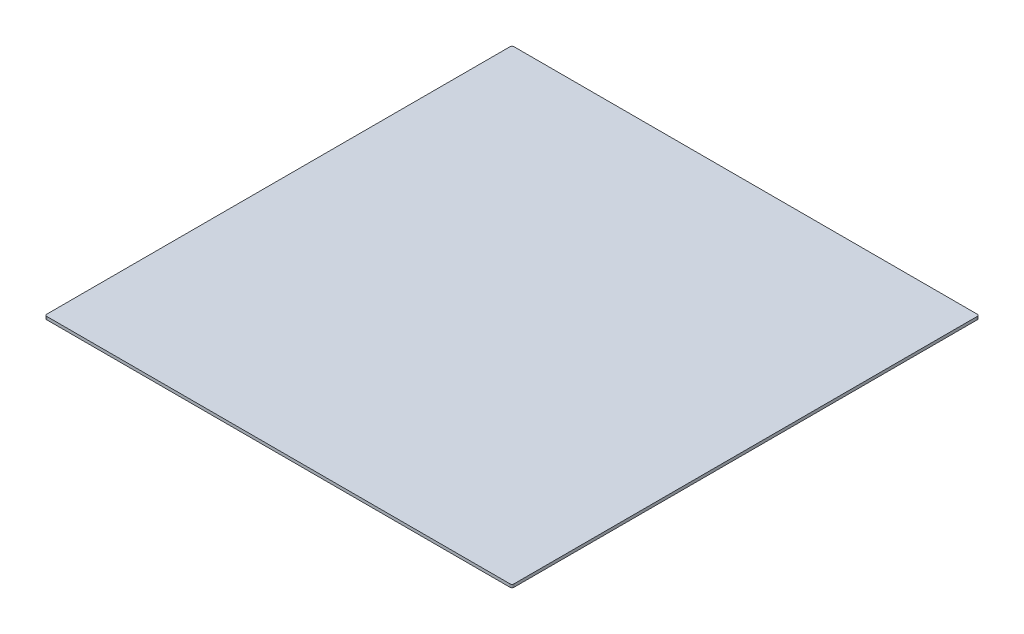
ISO-10303-21;
HEADER;
FILE_DESCRIPTION(('STEP AP214'),'2;1');
FILE_NAME('part.step','',(''),(''),'','','');
FILE_SCHEMA(('AUTOMOTIVE_DESIGN { 1 0 10303 214 1 1 1 1 }'));
ENDSEC;
DATA;
#1=APPLICATION_CONTEXT('core data for automotive mechanical design processes');
#2=APPLICATION_PROTOCOL_DEFINITION('international standard','automotive_design',2000,#1);
#3=PRODUCT_CONTEXT('',#1,'mechanical');
#4=PRODUCT('Part','Part','',(#3));
#5=PRODUCT_RELATED_PRODUCT_CATEGORY('part','',(#4));
#6=PRODUCT_DEFINITION_FORMATION('','',#4);
#7=PRODUCT_DEFINITION_CONTEXT('part definition',#1,'design');
#8=PRODUCT_DEFINITION('design','',#6,#7);
#9=PRODUCT_DEFINITION_SHAPE('','',#8);
#10=(LENGTH_UNIT() NAMED_UNIT(*) SI_UNIT(.MILLI.,.METRE.));
#11=(NAMED_UNIT(*) PLANE_ANGLE_UNIT() SI_UNIT($,.RADIAN.));
#12=(NAMED_UNIT(*) SI_UNIT($,.STERADIAN.) SOLID_ANGLE_UNIT());
#13=UNCERTAINTY_MEASURE_WITH_UNIT(LENGTH_MEASURE(1.E-05),#10,'distance_accuracy_value','');
#14=(GEOMETRIC_REPRESENTATION_CONTEXT(3) GLOBAL_UNCERTAINTY_ASSIGNED_CONTEXT((#13)) GLOBAL_UNIT_ASSIGNED_CONTEXT((#10,
#11,#12)) REPRESENTATION_CONTEXT('',''));
#15=CARTESIAN_POINT('',(0.,0.,0.));
#16=DIRECTION('',(0.,0.,1.));
#17=DIRECTION('',(1.,0.,0.));
#18=AXIS2_PLACEMENT_3D('',#15,#16,#17);
#19=CARTESIAN_POINT('',(232.5,3.,232.5));
#20=DIRECTION('',(0.,-1.,0.));
#21=DIRECTION('',(0.,0.,-1.));
#22=AXIS2_PLACEMENT_3D('',#19,#20,#21);
#23=CYLINDRICAL_SURFACE('',#22,2.);
#24=CARTESIAN_POINT('',(232.5,0.,232.5));
#25=DIRECTION('',(0.,1.,0.));
#26=DIRECTION('',(0.,0.,1.));
#27=AXIS2_PLACEMENT_3D('',#24,#25,#26);
#28=CIRCLE('',#27,2.);
#29=CARTESIAN_POINT('',(232.5,0.,234.5));
#30=VERTEX_POINT('',#29);
#31=CARTESIAN_POINT('',(234.5,0.,232.5));
#32=VERTEX_POINT('',#31);
#33=EDGE_CURVE('E208',#30,#32,#28,.T.);
#34=ORIENTED_EDGE('',*,*,#33,.T.);
#35=DIRECTION('',(0.,-1.,0.));
#36=VECTOR('',#35,1.);
#37=CARTESIAN_POINT('',(234.5,3.,232.5));
#38=LINE('',#37,#36);
#39=CARTESIAN_POINT('',(234.5,3.,232.5));
#40=VERTEX_POINT('',#39);
#41=EDGE_CURVE('E12',#40,#32,#38,.T.);
#42=ORIENTED_EDGE('',*,*,#41,.F.);
#43=CARTESIAN_POINT('',(232.5,3.,232.5));
#44=DIRECTION('',(0.,1.,0.));
#45=DIRECTION('',(0.,0.,1.));
#46=AXIS2_PLACEMENT_3D('',#43,#44,#45);
#47=CIRCLE('',#46,2.);
#48=CARTESIAN_POINT('',(232.5,3.,234.5));
#49=VERTEX_POINT('',#48);
#50=EDGE_CURVE('E162',#49,#40,#47,.T.);
#51=ORIENTED_EDGE('',*,*,#50,.F.);
#52=DIRECTION('',(0.,-1.,0.));
#53=VECTOR('',#52,1.);
#54=CARTESIAN_POINT('',(232.5,3.,234.5));
#55=LINE('',#54,#53);
#56=EDGE_CURVE('E137',#49,#30,#55,.T.);
#57=ORIENTED_EDGE('',*,*,#56,.T.);
#58=EDGE_LOOP('',(#34,#42,#51,#57));
#59=FACE_BOUND('',#58,.T.);
#60=ADVANCED_FACE('F40',(#59),#23,.T.);
#61=CARTESIAN_POINT('',(234.5,3.,232.5));
#62=DIRECTION('',(-1.,0.,0.));
#63=DIRECTION('',(0.,0.,1.));
#64=AXIS2_PLACEMENT_3D('',#61,#62,#63);
#65=PLANE('',#64);
#66=DIRECTION('',(0.,0.,-1.));
#67=VECTOR('',#66,1.);
#68=CARTESIAN_POINT('',(234.5,0.,232.5));
#69=LINE('',#68,#67);
#70=CARTESIAN_POINT('',(234.5,0.,-232.5));
#71=VERTEX_POINT('',#70);
#72=EDGE_CURVE('E199',#32,#71,#69,.T.);
#73=ORIENTED_EDGE('',*,*,#72,.T.);
#74=DIRECTION('',(0.,-1.,0.));
#75=VECTOR('',#74,1.);
#76=CARTESIAN_POINT('',(234.5,3.,-232.5));
#77=LINE('',#76,#75);
#78=CARTESIAN_POINT('',(234.5,3.,-232.5));
#79=VERTEX_POINT('',#78);
#80=EDGE_CURVE('E49',#79,#71,#77,.T.);
#81=ORIENTED_EDGE('',*,*,#80,.F.);
#82=DIRECTION('',(0.,0.,-1.));
#83=VECTOR('',#82,1.);
#84=CARTESIAN_POINT('',(234.5,3.,232.5));
#85=LINE('',#84,#83);
#86=EDGE_CURVE('E100',#40,#79,#85,.T.);
#87=ORIENTED_EDGE('',*,*,#86,.F.);
#88=ORIENTED_EDGE('',*,*,#41,.T.);
#89=EDGE_LOOP('',(#73,#81,#87,#88));
#90=FACE_BOUND('',#89,.T.);
#91=ADVANCED_FACE('F230',(#90),#65,.F.);
#92=CARTESIAN_POINT('',(232.5,3.,-232.5));
#93=DIRECTION('',(0.,-1.,0.));
#94=DIRECTION('',(0.,0.,-1.));
#95=AXIS2_PLACEMENT_3D('',#92,#93,#94);
#96=CYLINDRICAL_SURFACE('',#95,1.99999999999999);
#97=CARTESIAN_POINT('',(232.5,0.,-232.5));
#98=DIRECTION('',(0.,1.,0.));
#99=DIRECTION('',(0.,0.,-1.));
#100=AXIS2_PLACEMENT_3D('',#97,#98,#99);
#101=CIRCLE('',#100,1.99999999999999);
#102=CARTESIAN_POINT('',(232.5,0.,-234.5));
#103=VERTEX_POINT('',#102);
#104=EDGE_CURVE('E194',#71,#103,#101,.T.);
#105=ORIENTED_EDGE('',*,*,#104,.T.);
#106=DIRECTION('',(0.,-1.,0.));
#107=VECTOR('',#106,1.);
#108=CARTESIAN_POINT('',(232.5,3.,-234.5));
#109=LINE('',#108,#107);
#110=CARTESIAN_POINT('',(232.5,3.,-234.5));
#111=VERTEX_POINT('',#110);
#112=EDGE_CURVE('E184',#111,#103,#109,.T.);
#113=ORIENTED_EDGE('',*,*,#112,.F.);
#114=CARTESIAN_POINT('',(232.5,3.,-232.5));
#115=DIRECTION('',(0.,1.,0.));
#116=DIRECTION('',(0.,0.,-1.));
#117=AXIS2_PLACEMENT_3D('',#114,#115,#116);
#118=CIRCLE('',#117,1.99999999999999);
#119=EDGE_CURVE('E154',#79,#111,#118,.T.);
#120=ORIENTED_EDGE('',*,*,#119,.F.);
#121=ORIENTED_EDGE('',*,*,#80,.T.);
#122=EDGE_LOOP('',(#105,#113,#120,#121));
#123=FACE_BOUND('',#122,.T.);
#124=ADVANCED_FACE('F192',(#123),#96,.T.);
#125=CARTESIAN_POINT('',(-232.5,3.,-234.5));
#126=DIRECTION('',(0.,0.,1.));
#127=DIRECTION('',(1.,0.,0.));
#128=AXIS2_PLACEMENT_3D('',#125,#126,#127);
#129=PLANE('',#128);
#130=DIRECTION('',(-1.,0.,0.));
#131=VECTOR('',#130,1.);
#132=CARTESIAN_POINT('',(-232.5,0.,-234.5));
#133=LINE('',#132,#131);
#134=CARTESIAN_POINT('',(-232.5,0.,-234.5));
#135=VERTEX_POINT('',#134);
#136=EDGE_CURVE('E201',#103,#135,#133,.T.);
#137=ORIENTED_EDGE('',*,*,#136,.T.);
#138=DIRECTION('',(0.,-1.,0.));
#139=VECTOR('',#138,1.);
#140=CARTESIAN_POINT('',(-232.5,3.,-234.5));
#141=LINE('',#140,#139);
#142=CARTESIAN_POINT('',(-232.5,3.,-234.5));
#143=VERTEX_POINT('',#142);
#144=EDGE_CURVE('E180',#143,#135,#141,.T.);
#145=ORIENTED_EDGE('',*,*,#144,.F.);
#146=DIRECTION('',(-1.,0.,0.));
#147=VECTOR('',#146,1.);
#148=CARTESIAN_POINT('',(-232.5,3.,-234.5));
#149=LINE('',#148,#147);
#150=EDGE_CURVE('E150',#111,#143,#149,.T.);
#151=ORIENTED_EDGE('',*,*,#150,.F.);
#152=ORIENTED_EDGE('',*,*,#112,.T.);
#153=EDGE_LOOP('',(#137,#145,#151,#152));
#154=FACE_BOUND('',#153,.T.);
#155=ADVANCED_FACE('F237',(#154),#129,.F.);
#156=CARTESIAN_POINT('',(-232.5,3.,-232.5));
#157=DIRECTION('',(0.,-1.,0.));
#158=DIRECTION('',(0.,0.,-1.));
#159=AXIS2_PLACEMENT_3D('',#156,#157,#158);
#160=CYLINDRICAL_SURFACE('',#159,1.99999999999999);
#161=CARTESIAN_POINT('',(-232.5,0.,-232.5));
#162=DIRECTION('',(0.,1.,0.));
#163=DIRECTION('',(0.,0.,-1.));
#164=AXIS2_PLACEMENT_3D('',#161,#162,#163);
#165=CIRCLE('',#164,1.99999999999999);
#166=CARTESIAN_POINT('',(-234.5,0.,-232.5));
#167=VERTEX_POINT('',#166);
#168=EDGE_CURVE('E206',#135,#167,#165,.T.);
#169=ORIENTED_EDGE('',*,*,#168,.T.);
#170=DIRECTION('',(0.,-1.,0.));
#171=VECTOR('',#170,1.);
#172=CARTESIAN_POINT('',(-234.5,3.,-232.5));
#173=LINE('',#172,#171);
#174=CARTESIAN_POINT('',(-234.5,3.,-232.5));
#175=VERTEX_POINT('',#174);
#176=EDGE_CURVE('E130',#175,#167,#173,.T.);
#177=ORIENTED_EDGE('',*,*,#176,.F.);
#178=CARTESIAN_POINT('',(-232.5,3.,-232.5));
#179=DIRECTION('',(0.,1.,0.));
#180=DIRECTION('',(0.,0.,-1.));
#181=AXIS2_PLACEMENT_3D('',#178,#179,#180);
#182=CIRCLE('',#181,1.99999999999999);
#183=EDGE_CURVE('E119',#143,#175,#182,.T.);
#184=ORIENTED_EDGE('',*,*,#183,.F.);
#185=ORIENTED_EDGE('',*,*,#144,.T.);
#186=EDGE_LOOP('',(#169,#177,#184,#185));
#187=FACE_BOUND('',#186,.T.);
#188=ADVANCED_FACE('F214',(#187),#160,.T.);
#189=CARTESIAN_POINT('',(-234.5,3.,232.5));
#190=DIRECTION('',(1.,0.,0.));
#191=DIRECTION('',(0.,0.,-1.));
#192=AXIS2_PLACEMENT_3D('',#189,#190,#191);
#193=PLANE('',#192);
#194=DIRECTION('',(0.,0.,1.));
#195=VECTOR('',#194,1.);
#196=CARTESIAN_POINT('',(-234.5,0.,232.5));
#197=LINE('',#196,#195);
#198=CARTESIAN_POINT('',(-234.5,0.,232.5));
#199=VERTEX_POINT('',#198);
#200=EDGE_CURVE('E128',#167,#199,#197,.T.);
#201=ORIENTED_EDGE('',*,*,#200,.T.);
#202=DIRECTION('',(0.,-1.,0.));
#203=VECTOR('',#202,1.);
#204=CARTESIAN_POINT('',(-234.5,3.,232.5));
#205=LINE('',#204,#203);
#206=CARTESIAN_POINT('',(-234.5,3.,232.5));
#207=VERTEX_POINT('',#206);
#208=EDGE_CURVE('E125',#207,#199,#205,.T.);
#209=ORIENTED_EDGE('',*,*,#208,.F.);
#210=DIRECTION('',(0.,0.,1.));
#211=VECTOR('',#210,1.);
#212=CARTESIAN_POINT('',(-234.5,3.,232.5));
#213=LINE('',#212,#211);
#214=EDGE_CURVE('E113',#175,#207,#213,.T.);
#215=ORIENTED_EDGE('',*,*,#214,.F.);
#216=ORIENTED_EDGE('',*,*,#176,.T.);
#217=EDGE_LOOP('',(#201,#209,#215,#216));
#218=FACE_BOUND('',#217,.T.);
#219=ADVANCED_FACE('F126',(#218),#193,.F.);
#220=CARTESIAN_POINT('',(-232.5,3.,232.5));
#221=DIRECTION('',(0.,-1.,0.));
#222=DIRECTION('',(0.,0.,-1.));
#223=AXIS2_PLACEMENT_3D('',#220,#221,#222);
#224=CYLINDRICAL_SURFACE('',#223,2.);
#225=CARTESIAN_POINT('',(-232.5,0.,232.5));
#226=DIRECTION('',(0.,1.,0.));
#227=DIRECTION('',(0.,0.,-1.));
#228=AXIS2_PLACEMENT_3D('',#225,#226,#227);
#229=CIRCLE('',#228,2.);
#230=CARTESIAN_POINT('',(-232.5,0.,234.5));
#231=VERTEX_POINT('',#230);
#232=EDGE_CURVE('E86',#199,#231,#229,.T.);
#233=ORIENTED_EDGE('',*,*,#232,.T.);
#234=DIRECTION('',(0.,-1.,0.));
#235=VECTOR('',#234,1.);
#236=CARTESIAN_POINT('',(-232.5,3.,234.5));
#237=LINE('',#236,#235);
#238=CARTESIAN_POINT('',(-232.5,3.,234.5));
#239=VERTEX_POINT('',#238);
#240=EDGE_CURVE('E131',#239,#231,#237,.T.);
#241=ORIENTED_EDGE('',*,*,#240,.F.);
#242=CARTESIAN_POINT('',(-232.5,3.,232.5));
#243=DIRECTION('',(0.,1.,0.));
#244=DIRECTION('',(0.,0.,-1.));
#245=AXIS2_PLACEMENT_3D('',#242,#243,#244);
#246=CIRCLE('',#245,2.);
#247=EDGE_CURVE('E117',#207,#239,#246,.T.);
#248=ORIENTED_EDGE('',*,*,#247,.F.);
#249=ORIENTED_EDGE('',*,*,#208,.T.);
#250=EDGE_LOOP('',(#233,#241,#248,#249));
#251=FACE_BOUND('',#250,.T.);
#252=ADVANCED_FACE('F133',(#251),#224,.T.);
#253=CARTESIAN_POINT('',(-232.5,3.,234.5));
#254=DIRECTION('',(0.,0.,-1.));
#255=DIRECTION('',(-1.,0.,0.));
#256=AXIS2_PLACEMENT_3D('',#253,#254,#255);
#257=PLANE('',#256);
#258=DIRECTION('',(1.,0.,0.));
#259=VECTOR('',#258,1.);
#260=CARTESIAN_POINT('',(-232.5,0.,234.5));
#261=LINE('',#260,#259);
#262=EDGE_CURVE('E92',#231,#30,#261,.T.);
#263=ORIENTED_EDGE('',*,*,#262,.T.);
#264=ORIENTED_EDGE('',*,*,#56,.F.);
#265=DIRECTION('',(1.,0.,0.));
#266=VECTOR('',#265,1.);
#267=CARTESIAN_POINT('',(-232.5,3.,234.5));
#268=LINE('',#267,#266);
#269=EDGE_CURVE('E57',#239,#49,#268,.T.);
#270=ORIENTED_EDGE('',*,*,#269,.F.);
#271=ORIENTED_EDGE('',*,*,#240,.T.);
#272=EDGE_LOOP('',(#263,#264,#270,#271));
#273=FACE_BOUND('',#272,.T.);
#274=ADVANCED_FACE('F219',(#273),#257,.F.);
#275=CARTESIAN_POINT('',(232.5,3.,232.5));
#276=DIRECTION('',(0.,1.,0.));
#277=DIRECTION('',(0.,0.,1.));
#278=AXIS2_PLACEMENT_3D('',#275,#276,#277);
#279=PLANE('',#278);
#280=ORIENTED_EDGE('',*,*,#50,.T.);
#281=ORIENTED_EDGE('',*,*,#86,.T.);
#282=ORIENTED_EDGE('',*,*,#119,.T.);
#283=ORIENTED_EDGE('',*,*,#150,.T.);
#284=ORIENTED_EDGE('',*,*,#183,.T.);
#285=ORIENTED_EDGE('',*,*,#214,.T.);
#286=ORIENTED_EDGE('',*,*,#247,.T.);
#287=ORIENTED_EDGE('',*,*,#269,.T.);
#288=EDGE_LOOP('',(#280,#281,#282,#283,#284,#285,#286,#287));
#289=FACE_BOUND('',#288,.T.);
#290=ADVANCED_FACE('F115',(#289),#279,.T.);
#291=CARTESIAN_POINT('',(232.5,0.,232.5));
#292=DIRECTION('',(0.,1.,0.));
#293=DIRECTION('',(0.,0.,1.));
#294=AXIS2_PLACEMENT_3D('',#291,#292,#293);
#295=PLANE('',#294);
#296=ORIENTED_EDGE('',*,*,#33,.F.);
#297=ORIENTED_EDGE('',*,*,#262,.F.);
#298=ORIENTED_EDGE('',*,*,#232,.F.);
#299=ORIENTED_EDGE('',*,*,#200,.F.);
#300=ORIENTED_EDGE('',*,*,#168,.F.);
#301=ORIENTED_EDGE('',*,*,#136,.F.);
#302=ORIENTED_EDGE('',*,*,#104,.F.);
#303=ORIENTED_EDGE('',*,*,#72,.F.);
#304=EDGE_LOOP('',(#296,#297,#298,#299,#300,#301,#302,#303));
#305=FACE_BOUND('',#304,.T.);
#306=ADVANCED_FACE('F198',(#305),#295,.F.);
#307=CLOSED_SHELL('',(#60,#91,#124,#155,#188,#219,#252,#274,#290,#306));
#308=MANIFOLD_SOLID_BREP('B2',#307);
#309=ADVANCED_BREP_SHAPE_REPRESENTATION('',(#18,#308),#14);
#310=SHAPE_DEFINITION_REPRESENTATION(#9,#309);
ENDSEC;
END-ISO-10303-21;
